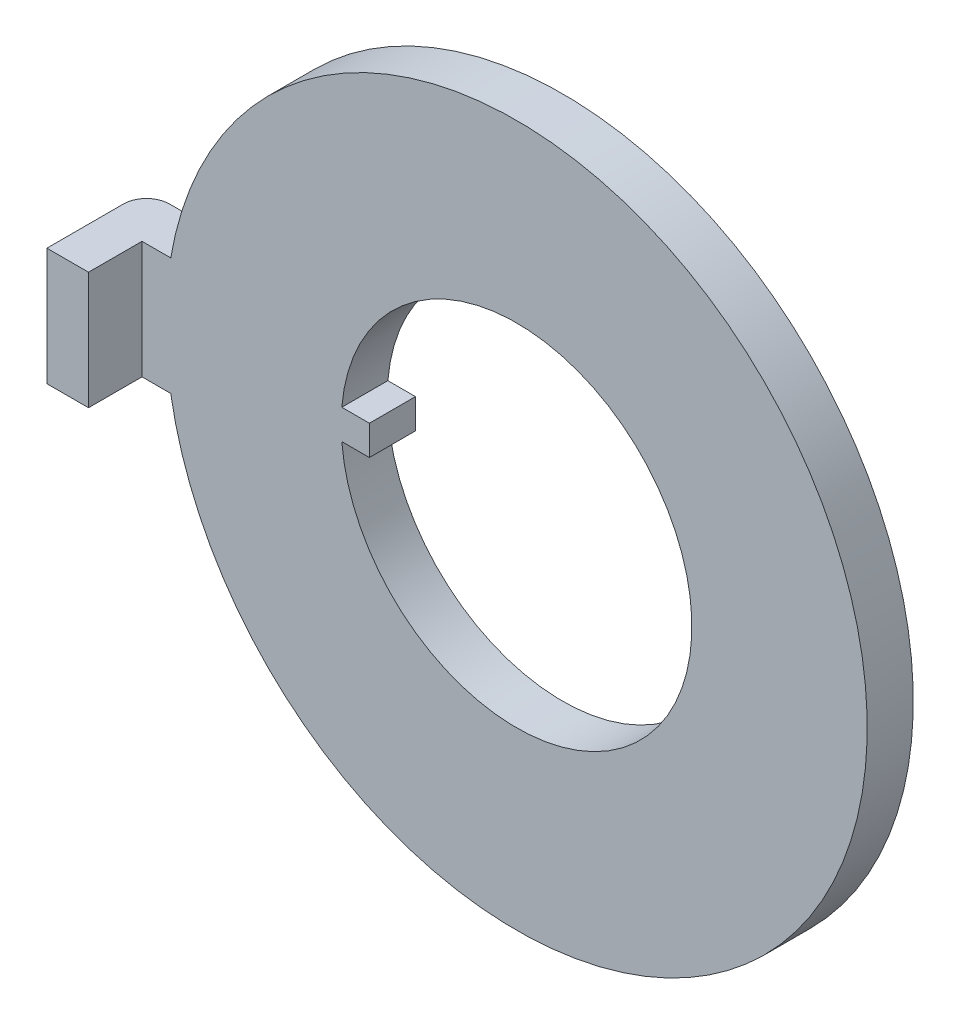
ISO-10303-21;
HEADER;
FILE_DESCRIPTION(('STEP AP214'),'2;1');
FILE_NAME('part.step','',(''),(''),'','','');
FILE_SCHEMA(('AUTOMOTIVE_DESIGN { 1 0 10303 214 1 1 1 1 }'));
ENDSEC;
DATA;
#1=APPLICATION_CONTEXT('core data for automotive mechanical design processes');
#2=APPLICATION_PROTOCOL_DEFINITION('international standard','automotive_design',2000,#1);
#3=PRODUCT_CONTEXT('',#1,'mechanical');
#4=PRODUCT('Part','Part','',(#3));
#5=PRODUCT_RELATED_PRODUCT_CATEGORY('part','',(#4));
#6=PRODUCT_DEFINITION_FORMATION('','',#4);
#7=PRODUCT_DEFINITION_CONTEXT('part definition',#1,'design');
#8=PRODUCT_DEFINITION('design','',#6,#7);
#9=PRODUCT_DEFINITION_SHAPE('','',#8);
#10=(LENGTH_UNIT() NAMED_UNIT(*) SI_UNIT(.MILLI.,.METRE.));
#11=(NAMED_UNIT(*) PLANE_ANGLE_UNIT() SI_UNIT($,.RADIAN.));
#12=(NAMED_UNIT(*) SI_UNIT($,.STERADIAN.) SOLID_ANGLE_UNIT());
#13=UNCERTAINTY_MEASURE_WITH_UNIT(LENGTH_MEASURE(1.E-05),#10,'distance_accuracy_value','');
#14=(GEOMETRIC_REPRESENTATION_CONTEXT(3) GLOBAL_UNCERTAINTY_ASSIGNED_CONTEXT((#13)) GLOBAL_UNIT_ASSIGNED_CONTEXT((#10,
#11,#12)) REPRESENTATION_CONTEXT('',''));
#15=CARTESIAN_POINT('',(0.,0.,0.));
#16=DIRECTION('',(0.,0.,1.));
#17=DIRECTION('',(1.,0.,0.));
#18=AXIS2_PLACEMENT_3D('',#15,#16,#17);
#19=CARTESIAN_POINT('',(-2.5146,-0.254,0.7874));
#20=DIRECTION('',(0.,-1.,0.));
#21=DIRECTION('',(0.,0.,-1.));
#22=AXIS2_PLACEMENT_3D('',#19,#20,#21);
#23=PLANE('',#22);
#24=DIRECTION('',(-1.,0.,0.));
#25=VECTOR('',#24,1.);
#26=CARTESIAN_POINT('',(-2.5146,-0.254,0.));
#27=LINE('',#26,#25);
#28=CARTESIAN_POINT('',(-2.5146,-0.254,0.));
#29=VERTEX_POINT('',#28);
#30=CARTESIAN_POINT('',(-2.98641789440125,-0.253999999999996,0.));
#31=VERTEX_POINT('',#30);
#32=EDGE_CURVE('E135',#29,#31,#27,.T.);
#33=ORIENTED_EDGE('',*,*,#32,.F.);
#34=DIRECTION('',(0.,0.,-1.));
#35=VECTOR('',#34,1.);
#36=CARTESIAN_POINT('',(-2.5146,-0.254,0.7874));
#37=LINE('',#36,#35);
#38=CARTESIAN_POINT('',(-2.5146,-0.254,0.7874));
#39=VERTEX_POINT('',#38);
#40=EDGE_CURVE('E11',#39,#29,#37,.T.);
#41=ORIENTED_EDGE('',*,*,#40,.F.);
#42=DIRECTION('',(-1.,0.,0.));
#43=VECTOR('',#42,1.);
#44=CARTESIAN_POINT('',(-2.5146,-0.254,0.7874));
#45=LINE('',#44,#43);
#46=CARTESIAN_POINT('',(-2.98641789440125,-0.253999999999996,0.7874));
#47=VERTEX_POINT('',#46);
#48=EDGE_CURVE('E144',#39,#47,#45,.T.);
#49=ORIENTED_EDGE('',*,*,#48,.T.);
#50=DIRECTION('',(0.,0.,-1.));
#51=VECTOR('',#50,1.);
#52=CARTESIAN_POINT('',(-2.98641789440125,-0.253999999999996,0.7874));
#53=LINE('',#52,#51);
#54=EDGE_CURVE('E20',#47,#31,#53,.T.);
#55=ORIENTED_EDGE('',*,*,#54,.T.);
#56=EDGE_LOOP('',(#33,#41,#49,#55));
#57=FACE_BOUND('',#56,.T.);
#58=ADVANCED_FACE('F16',(#57),#23,.T.);
#59=CARTESIAN_POINT('',(-2.5146,0.254,0.7874));
#60=DIRECTION('',(1.,0.,0.));
#61=DIRECTION('',(0.,0.,-1.));
#62=AXIS2_PLACEMENT_3D('',#59,#60,#61);
#63=PLANE('',#62);
#64=DIRECTION('',(0.,-1.,0.));
#65=VECTOR('',#64,1.);
#66=CARTESIAN_POINT('',(-2.5146,0.254,0.));
#67=LINE('',#66,#65);
#68=CARTESIAN_POINT('',(-2.5146,0.254,0.));
#69=VERTEX_POINT('',#68);
#70=EDGE_CURVE('E154',#69,#29,#67,.T.);
#71=ORIENTED_EDGE('',*,*,#70,.F.);
#72=DIRECTION('',(0.,0.,-1.));
#73=VECTOR('',#72,1.);
#74=CARTESIAN_POINT('',(-2.5146,0.254,0.7874));
#75=LINE('',#74,#73);
#76=CARTESIAN_POINT('',(-2.5146,0.254,0.7874));
#77=VERTEX_POINT('',#76);
#78=EDGE_CURVE('E25',#77,#69,#75,.T.);
#79=ORIENTED_EDGE('',*,*,#78,.F.);
#80=DIRECTION('',(0.,-1.,0.));
#81=VECTOR('',#80,1.);
#82=CARTESIAN_POINT('',(-2.5146,0.254,0.7874));
#83=LINE('',#82,#81);
#84=EDGE_CURVE('E141',#77,#39,#83,.T.);
#85=ORIENTED_EDGE('',*,*,#84,.T.);
#86=ORIENTED_EDGE('',*,*,#40,.T.);
#87=EDGE_LOOP('',(#71,#79,#85,#86));
#88=FACE_BOUND('',#87,.T.);
#89=ADVANCED_FACE('F172',(#88),#63,.T.);
#90=CARTESIAN_POINT('',(-2.98641789440125,0.254,0.7874));
#91=DIRECTION('',(0.,1.,0.));
#92=DIRECTION('',(0.,0.,1.));
#93=AXIS2_PLACEMENT_3D('',#90,#91,#92);
#94=PLANE('',#93);
#95=DIRECTION('',(1.,0.,0.));
#96=VECTOR('',#95,1.);
#97=CARTESIAN_POINT('',(-2.98641789440125,0.254,0.));
#98=LINE('',#97,#96);
#99=CARTESIAN_POINT('',(-2.98641789440125,0.254000000000001,0.));
#100=VERTEX_POINT('',#99);
#101=EDGE_CURVE('E151',#100,#69,#98,.T.);
#102=ORIENTED_EDGE('',*,*,#101,.F.);
#103=DIRECTION('',(0.,0.,-1.));
#104=VECTOR('',#103,1.);
#105=CARTESIAN_POINT('',(-2.98641789440125,0.254000000000001,0.7874));
#106=LINE('',#105,#104);
#107=CARTESIAN_POINT('',(-2.98641789440125,0.254000000000001,0.7874));
#108=VERTEX_POINT('',#107);
#109=EDGE_CURVE('E159',#108,#100,#106,.T.);
#110=ORIENTED_EDGE('',*,*,#109,.F.);
#111=DIRECTION('',(1.,0.,0.));
#112=VECTOR('',#111,1.);
#113=CARTESIAN_POINT('',(-2.98641789440125,0.254,0.7874));
#114=LINE('',#113,#112);
#115=EDGE_CURVE('E138',#108,#77,#114,.T.);
#116=ORIENTED_EDGE('',*,*,#115,.T.);
#117=ORIENTED_EDGE('',*,*,#78,.T.);
#118=EDGE_LOOP('',(#102,#110,#116,#117));
#119=FACE_BOUND('',#118,.T.);
#120=ADVANCED_FACE('F178',(#119),#94,.T.);
#121=CARTESIAN_POINT('',(0.,0.,0.7874));
#122=DIRECTION('',(0.,0.,-1.));
#123=DIRECTION('',(-1.,0.,0.));
#124=AXIS2_PLACEMENT_3D('',#121,#122,#123);
#125=CYLINDRICAL_SURFACE('',#124,2.9972);
#126=CARTESIAN_POINT('',(0.,0.,0.));
#127=DIRECTION('',(0.,0.,1.));
#128=DIRECTION('',(1.,0.,0.));
#129=AXIS2_PLACEMENT_3D('',#126,#127,#128);
#130=CIRCLE('',#129,2.9972);
#131=EDGE_CURVE('E148',#31,#100,#130,.T.);
#132=ORIENTED_EDGE('',*,*,#131,.F.);
#133=ORIENTED_EDGE('',*,*,#54,.F.);
#134=CARTESIAN_POINT('',(0.,0.,0.7874));
#135=DIRECTION('',(0.,0.,1.));
#136=DIRECTION('',(1.,0.,0.));
#137=AXIS2_PLACEMENT_3D('',#134,#135,#136);
#138=CIRCLE('',#137,2.9972);
#139=EDGE_CURVE('E134',#47,#108,#138,.T.);
#140=ORIENTED_EDGE('',*,*,#139,.T.);
#141=ORIENTED_EDGE('',*,*,#109,.T.);
#142=EDGE_LOOP('',(#132,#133,#140,#141));
#143=FACE_BOUND('',#142,.T.);
#144=ADVANCED_FACE('F167',(#143),#125,.F.);
#145=CARTESIAN_POINT('',(0.,0.,0.7874));
#146=DIRECTION('',(0.,0.,-1.));
#147=DIRECTION('',(-1.,0.,0.));
#148=AXIS2_PLACEMENT_3D('',#145,#146,#147);
#149=CYLINDRICAL_SURFACE('',#148,5.9944);
#150=CARTESIAN_POINT('',(0.,0.,0.));
#151=DIRECTION('',(0.,0.,1.));
#152=DIRECTION('',(1.,0.,0.));
#153=AXIS2_PLACEMENT_3D('',#150,#151,#152);
#154=CIRCLE('',#153,5.9944);
#155=CARTESIAN_POINT('',(-5.90984098517041,-1.0033,0.));
#156=VERTEX_POINT('',#155);
#157=CARTESIAN_POINT('',(-5.90984098517041,1.0033,0.));
#158=VERTEX_POINT('',#157);
#159=EDGE_CURVE('E131',#156,#158,#154,.T.);
#160=ORIENTED_EDGE('',*,*,#159,.T.);
#161=DIRECTION('',(0.,0.,-1.));
#162=VECTOR('',#161,1.);
#163=CARTESIAN_POINT('',(-5.90984098517041,1.0033,0.7874));
#164=LINE('',#163,#162);
#165=CARTESIAN_POINT('',(-5.90984098517041,1.0033,0.7874));
#166=VERTEX_POINT('',#165);
#167=EDGE_CURVE('E33',#158,#166,#164,.F.);
#168=ORIENTED_EDGE('',*,*,#167,.T.);
#169=CARTESIAN_POINT('',(0.,0.,0.7874));
#170=DIRECTION('',(0.,0.,1.));
#171=DIRECTION('',(1.,0.,0.));
#172=AXIS2_PLACEMENT_3D('',#169,#170,#171);
#173=CIRCLE('',#172,5.9944);
#174=CARTESIAN_POINT('',(-5.90984098517041,-1.0033,0.7874));
#175=VERTEX_POINT('',#174);
#176=EDGE_CURVE('E132',#175,#166,#173,.T.);
#177=ORIENTED_EDGE('',*,*,#176,.F.);
#178=DIRECTION('',(0.,0.,-1.));
#179=VECTOR('',#178,1.);
#180=CARTESIAN_POINT('',(-5.90984098517041,-1.0033,0.7874));
#181=LINE('',#180,#179);
#182=EDGE_CURVE('E38',#156,#175,#181,.F.);
#183=ORIENTED_EDGE('',*,*,#182,.F.);
#184=EDGE_LOOP('',(#160,#168,#177,#183));
#185=FACE_BOUND('',#184,.T.);
#186=ADVANCED_FACE('F18',(#185),#149,.T.);
#187=CARTESIAN_POINT('',(0.,0.,0.7874));
#188=DIRECTION('',(0.,0.,1.));
#189=DIRECTION('',(1.,0.,0.));
#190=AXIS2_PLACEMENT_3D('',#187,#188,#189);
#191=PLANE('',#190);
#192=ORIENTED_EDGE('',*,*,#176,.T.);
#193=DIRECTION('',(1.,0.,0.));
#194=VECTOR('',#193,1.);
#195=CARTESIAN_POINT('',(-6.4008,1.0033,0.7874));
#196=LINE('',#195,#194);
#197=CARTESIAN_POINT('',(-6.4008,1.0033,0.7874));
#198=VERTEX_POINT('',#197);
#199=EDGE_CURVE('E300',#198,#166,#196,.T.);
#200=ORIENTED_EDGE('',*,*,#199,.F.);
#201=DIRECTION('',(0.,-1.,0.));
#202=VECTOR('',#201,1.);
#203=CARTESIAN_POINT('',(-6.4008,1.0033,0.7874));
#204=LINE('',#203,#202);
#205=CARTESIAN_POINT('',(-6.4008,-1.0033,0.7874));
#206=VERTEX_POINT('',#205);
#207=EDGE_CURVE('E303',#198,#206,#204,.T.);
#208=ORIENTED_EDGE('',*,*,#207,.T.);
#209=DIRECTION('',(1.,0.,0.));
#210=VECTOR('',#209,1.);
#211=CARTESIAN_POINT('',(-6.4008,-1.0033,0.7874));
#212=LINE('',#211,#210);
#213=EDGE_CURVE('E316',#206,#175,#212,.T.);
#214=ORIENTED_EDGE('',*,*,#213,.T.);
#215=EDGE_LOOP('',(#192,#200,#208,#214));
#216=FACE_BOUND('',#215,.T.);
#217=ORIENTED_EDGE('',*,*,#48,.F.);
#218=ORIENTED_EDGE('',*,*,#84,.F.);
#219=ORIENTED_EDGE('',*,*,#115,.F.);
#220=ORIENTED_EDGE('',*,*,#139,.F.);
#221=EDGE_LOOP('',(#217,#218,#219,#220));
#222=FACE_BOUND('',#221,.T.);
#223=ADVANCED_FACE('F176',(#216,#222),#191,.T.);
#224=CARTESIAN_POINT('',(0.,0.,0.));
#225=DIRECTION('',(0.,0.,1.));
#226=DIRECTION('',(1.,0.,0.));
#227=AXIS2_PLACEMENT_3D('',#224,#225,#226);
#228=PLANE('',#227);
#229=ORIENTED_EDGE('',*,*,#159,.F.);
#230=DIRECTION('',(-1.,0.,0.));
#231=VECTOR('',#230,1.);
#232=CARTESIAN_POINT('',(-4.4958,-1.0033,0.));
#233=LINE('',#232,#231);
#234=CARTESIAN_POINT('',(-6.7183,-1.0033,0.));
#235=VERTEX_POINT('',#234);
#236=EDGE_CURVE('E119',#156,#235,#233,.T.);
#237=ORIENTED_EDGE('',*,*,#236,.T.);
#238=DIRECTION('',(0.,-1.,0.));
#239=VECTOR('',#238,1.);
#240=CARTESIAN_POINT('',(-6.7183,1.0033,0.));
#241=LINE('',#240,#239);
#242=CARTESIAN_POINT('',(-6.7183,1.0033,0.));
#243=VERTEX_POINT('',#242);
#244=EDGE_CURVE('E301',#243,#235,#241,.T.);
#245=ORIENTED_EDGE('',*,*,#244,.F.);
#246=DIRECTION('',(-1.,0.,0.));
#247=VECTOR('',#246,1.);
#248=CARTESIAN_POINT('',(-4.4958,1.0033,0.));
#249=LINE('',#248,#247);
#250=EDGE_CURVE('E115',#158,#243,#249,.T.);
#251=ORIENTED_EDGE('',*,*,#250,.F.);
#252=EDGE_LOOP('',(#229,#237,#245,#251));
#253=FACE_BOUND('',#252,.T.);
#254=ORIENTED_EDGE('',*,*,#32,.T.);
#255=ORIENTED_EDGE('',*,*,#131,.T.);
#256=ORIENTED_EDGE('',*,*,#101,.T.);
#257=ORIENTED_EDGE('',*,*,#70,.T.);
#258=EDGE_LOOP('',(#254,#255,#256,#257));
#259=FACE_BOUND('',#258,.T.);
#260=ADVANCED_FACE('F169',(#253,#259),#228,.F.);
#261=CARTESIAN_POINT('',(-6.7183,1.0033,0.3937));
#262=DIRECTION('',(0.,1.,0.));
#263=DIRECTION('',(0.,0.,1.));
#264=AXIS2_PLACEMENT_3D('',#261,#262,#263);
#265=PLANE('',#264);
#266=ORIENTED_EDGE('',*,*,#167,.F.);
#267=ORIENTED_EDGE('',*,*,#250,.T.);
#268=CARTESIAN_POINT('',(-6.7183,1.0033,0.3937));
#269=DIRECTION('',(0.,1.,0.));
#270=DIRECTION('',(1.,0.,0.));
#271=AXIS2_PLACEMENT_3D('',#268,#269,#270);
#272=CIRCLE('',#271,0.3937);
#273=CARTESIAN_POINT('',(-7.112,1.0033,0.3937));
#274=VERTEX_POINT('',#273);
#275=EDGE_CURVE('E110',#243,#274,#272,.T.);
#276=ORIENTED_EDGE('',*,*,#275,.T.);
#277=DIRECTION('',(0.,0.,1.));
#278=VECTOR('',#277,1.);
#279=CARTESIAN_POINT('',(-7.112,1.0033,0.3937));
#280=LINE('',#279,#278);
#281=CARTESIAN_POINT('',(-7.112,1.0033,1.7018));
#282=VERTEX_POINT('',#281);
#283=EDGE_CURVE('E99',#274,#282,#280,.T.);
#284=ORIENTED_EDGE('',*,*,#283,.T.);
#285=DIRECTION('',(1.,0.,0.));
#286=VECTOR('',#285,1.);
#287=CARTESIAN_POINT('',(-7.112,1.0033,1.7018));
#288=LINE('',#287,#286);
#289=CARTESIAN_POINT('',(-6.4008,1.0033,1.7018));
#290=VERTEX_POINT('',#289);
#291=EDGE_CURVE('E109',#282,#290,#288,.T.);
#292=ORIENTED_EDGE('',*,*,#291,.T.);
#293=DIRECTION('',(0.,0.,-1.));
#294=VECTOR('',#293,1.);
#295=CARTESIAN_POINT('',(-6.4008,1.0033,1.7018));
#296=LINE('',#295,#294);
#297=EDGE_CURVE('E305',#290,#198,#296,.T.);
#298=ORIENTED_EDGE('',*,*,#297,.T.);
#299=ORIENTED_EDGE('',*,*,#199,.T.);
#300=EDGE_LOOP('',(#266,#267,#276,#284,#292,#298,#299));
#301=FACE_BOUND('',#300,.T.);
#302=ADVANCED_FACE('F113',(#301),#265,.T.);
#303=CARTESIAN_POINT('',(-6.7183,-1.0033,0.3937));
#304=DIRECTION('',(0.,1.,0.));
#305=DIRECTION('',(0.,0.,1.));
#306=AXIS2_PLACEMENT_3D('',#303,#304,#305);
#307=PLANE('',#306);
#308=ORIENTED_EDGE('',*,*,#236,.F.);
#309=ORIENTED_EDGE('',*,*,#182,.T.);
#310=ORIENTED_EDGE('',*,*,#213,.F.);
#311=DIRECTION('',(0.,0.,-1.));
#312=VECTOR('',#311,1.);
#313=CARTESIAN_POINT('',(-6.4008,-1.0033,1.7018));
#314=LINE('',#313,#312);
#315=CARTESIAN_POINT('',(-6.4008,-1.0033,1.7018));
#316=VERTEX_POINT('',#315);
#317=EDGE_CURVE('E314',#316,#206,#314,.T.);
#318=ORIENTED_EDGE('',*,*,#317,.F.);
#319=DIRECTION('',(1.,0.,0.));
#320=VECTOR('',#319,1.);
#321=CARTESIAN_POINT('',(-7.112,-1.0033,1.7018));
#322=LINE('',#321,#320);
#323=CARTESIAN_POINT('',(-7.112,-1.0033,1.7018));
#324=VERTEX_POINT('',#323);
#325=EDGE_CURVE('E312',#324,#316,#322,.T.);
#326=ORIENTED_EDGE('',*,*,#325,.F.);
#327=DIRECTION('',(0.,0.,1.));
#328=VECTOR('',#327,1.);
#329=CARTESIAN_POINT('',(-7.112,-1.0033,0.3937));
#330=LINE('',#329,#328);
#331=CARTESIAN_POINT('',(-7.112,-1.0033,0.3937));
#332=VERTEX_POINT('',#331);
#333=EDGE_CURVE('E310',#332,#324,#330,.T.);
#334=ORIENTED_EDGE('',*,*,#333,.F.);
#335=CARTESIAN_POINT('',(-6.7183,-1.0033,0.3937));
#336=DIRECTION('',(0.,1.,0.));
#337=DIRECTION('',(1.,0.,0.));
#338=AXIS2_PLACEMENT_3D('',#335,#336,#337);
#339=CIRCLE('',#338,0.3937);
#340=EDGE_CURVE('E123',#235,#332,#339,.T.);
#341=ORIENTED_EDGE('',*,*,#340,.F.);
#342=EDGE_LOOP('',(#308,#309,#310,#318,#326,#334,#341));
#343=FACE_BOUND('',#342,.T.);
#344=ADVANCED_FACE('F200',(#343),#307,.F.);
#345=CARTESIAN_POINT('',(-6.7183,1.0033,0.3937));
#346=DIRECTION('',(0.,-1.,0.));
#347=DIRECTION('',(0.,0.,-1.));
#348=AXIS2_PLACEMENT_3D('',#345,#346,#347);
#349=CYLINDRICAL_SURFACE('',#348,0.3937);
#350=ORIENTED_EDGE('',*,*,#340,.T.);
#351=DIRECTION('',(0.,-1.,0.));
#352=VECTOR('',#351,1.);
#353=CARTESIAN_POINT('',(-7.112,1.0033,0.3937));
#354=LINE('',#353,#352);
#355=EDGE_CURVE('E103',#274,#332,#354,.T.);
#356=ORIENTED_EDGE('',*,*,#355,.F.);
#357=ORIENTED_EDGE('',*,*,#275,.F.);
#358=ORIENTED_EDGE('',*,*,#244,.T.);
#359=EDGE_LOOP('',(#350,#356,#357,#358));
#360=FACE_BOUND('',#359,.T.);
#361=ADVANCED_FACE('F121',(#360),#349,.T.);
#362=CARTESIAN_POINT('',(-7.112,1.0033,0.3937));
#363=DIRECTION('',(1.,0.,0.));
#364=DIRECTION('',(0.,0.,-1.));
#365=AXIS2_PLACEMENT_3D('',#362,#363,#364);
#366=PLANE('',#365);
#367=ORIENTED_EDGE('',*,*,#333,.T.);
#368=DIRECTION('',(0.,-1.,0.));
#369=VECTOR('',#368,1.);
#370=CARTESIAN_POINT('',(-7.112,1.0033,1.7018));
#371=LINE('',#370,#369);
#372=EDGE_CURVE('E106',#282,#324,#371,.T.);
#373=ORIENTED_EDGE('',*,*,#372,.F.);
#374=ORIENTED_EDGE('',*,*,#283,.F.);
#375=ORIENTED_EDGE('',*,*,#355,.T.);
#376=EDGE_LOOP('',(#367,#373,#374,#375));
#377=FACE_BOUND('',#376,.T.);
#378=ADVANCED_FACE('F101',(#377),#366,.F.);
#379=CARTESIAN_POINT('',(-7.112,1.0033,1.7018));
#380=DIRECTION('',(0.,0.,-1.));
#381=DIRECTION('',(-1.,0.,0.));
#382=AXIS2_PLACEMENT_3D('',#379,#380,#381);
#383=PLANE('',#382);
#384=ORIENTED_EDGE('',*,*,#325,.T.);
#385=DIRECTION('',(0.,-1.,0.));
#386=VECTOR('',#385,1.);
#387=CARTESIAN_POINT('',(-6.4008,1.0033,1.7018));
#388=LINE('',#387,#386);
#389=EDGE_CURVE('E126',#290,#316,#388,.T.);
#390=ORIENTED_EDGE('',*,*,#389,.F.);
#391=ORIENTED_EDGE('',*,*,#291,.F.);
#392=ORIENTED_EDGE('',*,*,#372,.T.);
#393=EDGE_LOOP('',(#384,#390,#391,#392));
#394=FACE_BOUND('',#393,.T.);
#395=ADVANCED_FACE('F203',(#394),#383,.F.);
#396=CARTESIAN_POINT('',(-6.4008,1.0033,1.7018));
#397=DIRECTION('',(-1.,0.,0.));
#398=DIRECTION('',(0.,0.,1.));
#399=AXIS2_PLACEMENT_3D('',#396,#397,#398);
#400=PLANE('',#399);
#401=ORIENTED_EDGE('',*,*,#317,.T.);
#402=ORIENTED_EDGE('',*,*,#207,.F.);
#403=ORIENTED_EDGE('',*,*,#297,.F.);
#404=ORIENTED_EDGE('',*,*,#389,.T.);
#405=EDGE_LOOP('',(#401,#402,#403,#404));
#406=FACE_BOUND('',#405,.T.);
#407=ADVANCED_FACE('F206',(#406),#400,.F.);
#408=CLOSED_SHELL('',(#58,#89,#120,#144,#186,#223,#260,#302,#344,#361,#378,#395,#407));
#409=MANIFOLD_SOLID_BREP('B1',#408);
#410=ADVANCED_BREP_SHAPE_REPRESENTATION('',(#18,#409),#14);
#411=SHAPE_DEFINITION_REPRESENTATION(#9,#410);
ENDSEC;
END-ISO-10303-21;
